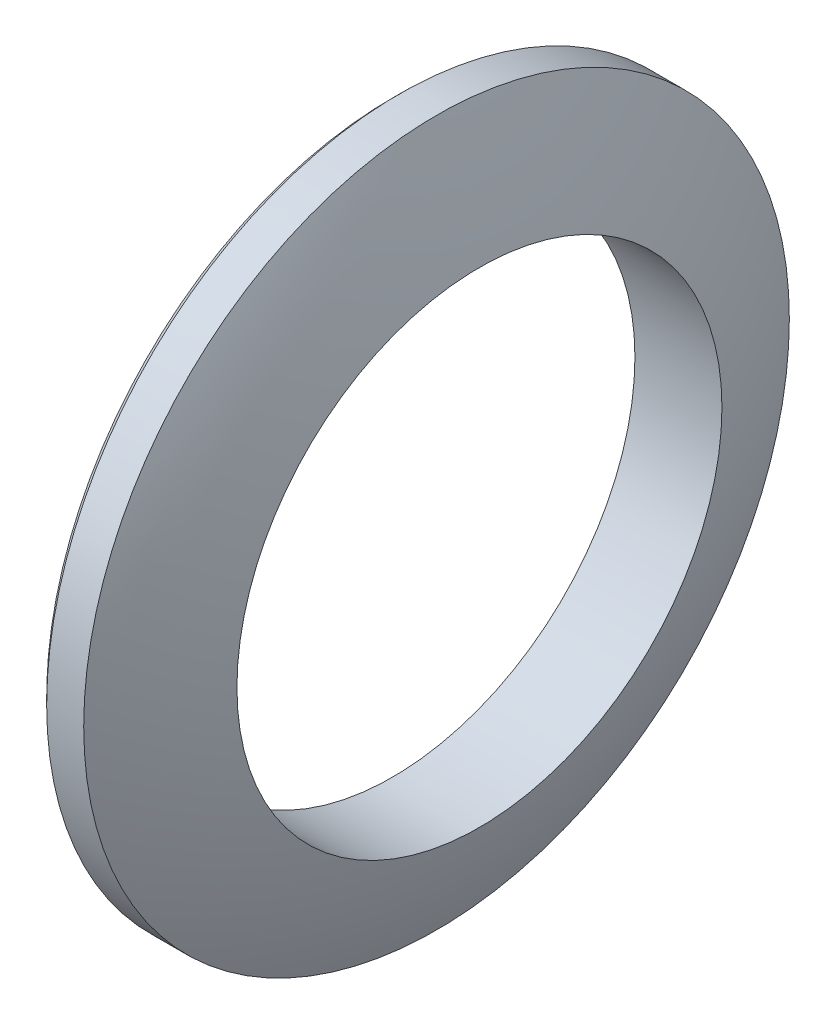
ISO-10303-21;
HEADER;
FILE_DESCRIPTION(('STEP AP214'),'2;1');
FILE_NAME('part.step','',(''),(''),'','','');
FILE_SCHEMA(('AUTOMOTIVE_DESIGN { 1 0 10303 214 1 1 1 1 }'));
ENDSEC;
DATA;
#1=APPLICATION_CONTEXT('core data for automotive mechanical design processes');
#2=APPLICATION_PROTOCOL_DEFINITION('international standard','automotive_design',2000,#1);
#3=PRODUCT_CONTEXT('',#1,'mechanical');
#4=PRODUCT('Part','Part','',(#3));
#5=PRODUCT_RELATED_PRODUCT_CATEGORY('part','',(#4));
#6=PRODUCT_DEFINITION_FORMATION('','',#4);
#7=PRODUCT_DEFINITION_CONTEXT('part definition',#1,'design');
#8=PRODUCT_DEFINITION('design','',#6,#7);
#9=PRODUCT_DEFINITION_SHAPE('','',#8);
#10=(LENGTH_UNIT() NAMED_UNIT(*) SI_UNIT(.MILLI.,.METRE.));
#11=(NAMED_UNIT(*) PLANE_ANGLE_UNIT() SI_UNIT($,.RADIAN.));
#12=(NAMED_UNIT(*) SI_UNIT($,.STERADIAN.) SOLID_ANGLE_UNIT());
#13=UNCERTAINTY_MEASURE_WITH_UNIT(LENGTH_MEASURE(1.E-05),#10,'distance_accuracy_value','');
#14=(GEOMETRIC_REPRESENTATION_CONTEXT(3) GLOBAL_UNCERTAINTY_ASSIGNED_CONTEXT((#13)) GLOBAL_UNIT_ASSIGNED_CONTEXT((#10,
#11,#12)) REPRESENTATION_CONTEXT('',''));
#15=CARTESIAN_POINT('',(0.,0.,0.));
#16=DIRECTION('',(0.,0.,1.));
#17=DIRECTION('',(1.,0.,0.));
#18=AXIS2_PLACEMENT_3D('',#15,#16,#17);
#19=CARTESIAN_POINT('',(0.,38.1,0.));
#20=DIRECTION('',(1.,0.,0.));
#21=DIRECTION('',(0.,0.,-1.));
#22=AXIS2_PLACEMENT_3D('',#19,#20,#21);
#23=PLANE('',#22);
#24=CARTESIAN_POINT('',(0.,0.,0.));
#25=DIRECTION('',(1.,0.,0.));
#26=DIRECTION('',(0.,0.,-1.));
#27=AXIS2_PLACEMENT_3D('',#24,#25,#26);
#28=CIRCLE('',#27,37.338);
#29=CARTESIAN_POINT('',(0.,0.,-37.338));
#30=VERTEX_POINT('',#29);
#31=EDGE_CURVE('E37',#30,#30,#28,.F.);
#32=ORIENTED_EDGE('',*,*,#31,.T.);
#33=EDGE_LOOP('',(#32));
#34=FACE_BOUND('',#33,.T.);
#35=CARTESIAN_POINT('',(0.,0.,0.));
#36=DIRECTION('',(-1.,0.,0.));
#37=DIRECTION('',(0.,0.,1.));
#38=AXIS2_PLACEMENT_3D('',#35,#36,#37);
#39=CIRCLE('',#38,26.1874);
#40=CARTESIAN_POINT('',(0.,0.,26.1874));
#41=VERTEX_POINT('',#40);
#42=EDGE_CURVE('E41',#41,#41,#39,.T.);
#43=ORIENTED_EDGE('',*,*,#42,.F.);
#44=EDGE_LOOP('',(#43));
#45=FACE_BOUND('',#44,.T.);
#46=ADVANCED_FACE('F30',(#34,#45),#23,.F.);
#47=CARTESIAN_POINT('',(0.,0.,0.));
#48=DIRECTION('',(-1.,0.,0.));
#49=DIRECTION('',(0.,0.,1.));
#50=AXIS2_PLACEMENT_3D('',#47,#48,#49);
#51=CYLINDRICAL_SURFACE('',#50,26.1874);
#52=CARTESIAN_POINT('',(9.39610682804447,0.,0.));
#53=DIRECTION('',(-1.,0.,0.));
#54=DIRECTION('',(0.,0.,1.));
#55=AXIS2_PLACEMENT_3D('',#52,#53,#54);
#56=CIRCLE('',#55,26.1874);
#57=CARTESIAN_POINT('',(9.39610682804447,0.,26.1874));
#58=VERTEX_POINT('',#57);
#59=EDGE_CURVE('E45',#58,#58,#56,.T.);
#60=ORIENTED_EDGE('',*,*,#59,.F.);
#61=EDGE_LOOP('',(#60));
#62=FACE_BOUND('',#61,.T.);
#63=ORIENTED_EDGE('',*,*,#42,.T.);
#64=EDGE_LOOP('',(#63));
#65=FACE_BOUND('',#64,.T.);
#66=ADVANCED_FACE('F59',(#62,#65),#51,.F.);
#67=CARTESIAN_POINT('',(-75.5593525682768,0.,0.));
#68=DIRECTION('',(-1.,0.,0.));
#69=DIRECTION('',(0.,1.,0.));
#70=AXIS2_PLACEMENT_3D('',#67,#68,#69);
#71=SPHERICAL_SURFACE('',#70,88.9);
#72=CARTESIAN_POINT('',(4.7625,0.,0.));
#73=DIRECTION('',(-1.,0.,0.));
#74=DIRECTION('',(0.,0.,1.));
#75=AXIS2_PLACEMENT_3D('',#72,#73,#74);
#76=CIRCLE('',#75,38.1);
#77=CARTESIAN_POINT('',(4.7625,0.,38.1));
#78=VERTEX_POINT('',#77);
#79=EDGE_CURVE('E50',#78,#78,#76,.T.);
#80=ORIENTED_EDGE('',*,*,#79,.F.);
#81=EDGE_LOOP('',(#80));
#82=FACE_BOUND('',#81,.T.);
#83=ORIENTED_EDGE('',*,*,#59,.T.);
#84=EDGE_LOOP('',(#83));
#85=FACE_BOUND('',#84,.T.);
#86=ADVANCED_FACE('F56',(#82,#85),#71,.T.);
#87=CARTESIAN_POINT('',(0.,0.,0.));
#88=DIRECTION('',(-1.,0.,0.));
#89=DIRECTION('',(0.,0.,1.));
#90=AXIS2_PLACEMENT_3D('',#87,#88,#89);
#91=CYLINDRICAL_SURFACE('',#90,38.1);
#92=CARTESIAN_POINT('',(0.761999999999977,0.,0.));
#93=DIRECTION('',(1.,0.,0.));
#94=DIRECTION('',(0.,0.,-1.));
#95=AXIS2_PLACEMENT_3D('',#92,#93,#94);
#96=CIRCLE('',#95,38.1);
#97=CARTESIAN_POINT('',(0.761999999999977,0.,-38.1));
#98=VERTEX_POINT('',#97);
#99=EDGE_CURVE('E10',#98,#98,#96,.T.);
#100=ORIENTED_EDGE('',*,*,#99,.T.);
#101=EDGE_LOOP('',(#100));
#102=FACE_BOUND('',#101,.T.);
#103=ORIENTED_EDGE('',*,*,#79,.T.);
#104=EDGE_LOOP('',(#103));
#105=FACE_BOUND('',#104,.T.);
#106=ADVANCED_FACE('F54',(#102,#105),#91,.T.);
#107=CARTESIAN_POINT('',(0.,0.,0.));
#108=DIRECTION('',(1.,0.,0.));
#109=DIRECTION('',(0.,0.,-1.));
#110=AXIS2_PLACEMENT_3D('',#107,#108,#109);
#111=CONICAL_SURFACE('',#110,37.338,0.785398163397457);
#112=ORIENTED_EDGE('',*,*,#99,.F.);
#113=EDGE_LOOP('',(#112));
#114=FACE_BOUND('',#113,.T.);
#115=ORIENTED_EDGE('',*,*,#31,.F.);
#116=EDGE_LOOP('',(#115));
#117=FACE_BOUND('',#116,.T.);
#118=ADVANCED_FACE('F32',(#114,#117),#111,.T.);
#119=CLOSED_SHELL('',(#46,#66,#86,#106,#118));
#120=MANIFOLD_SOLID_BREP('B2',#119);
#121=ADVANCED_BREP_SHAPE_REPRESENTATION('',(#18,#120),#14);
#122=SHAPE_DEFINITION_REPRESENTATION(#9,#121);
ENDSEC;
END-ISO-10303-21;
